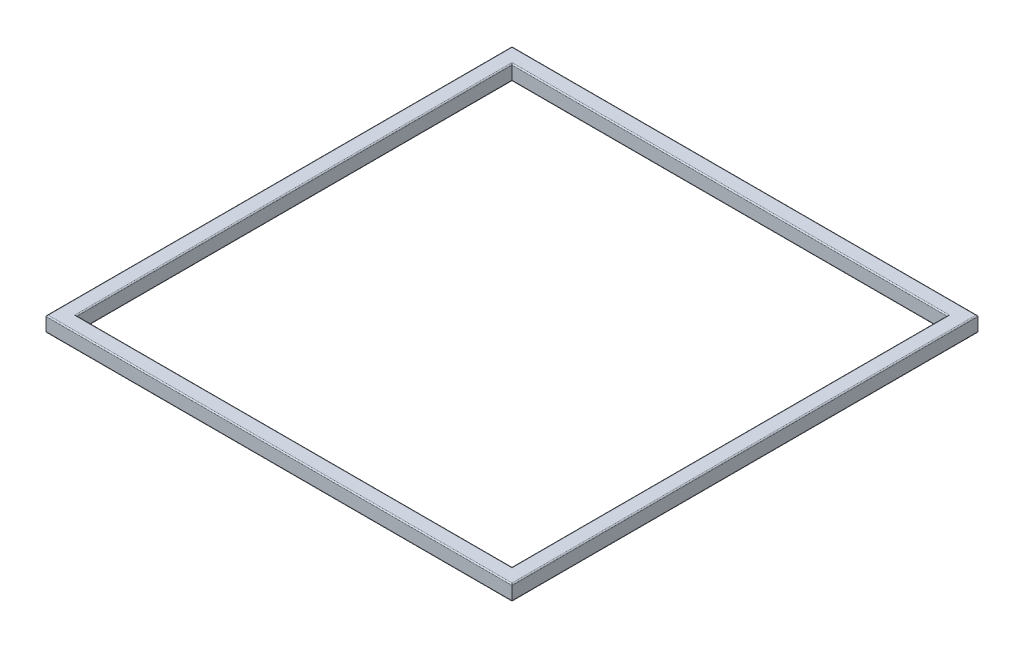
ISO-10303-21;
HEADER;
FILE_DESCRIPTION(('STEP AP214'),'2;1');
FILE_NAME('part.step','',(''),(''),'','','');
FILE_SCHEMA(('AUTOMOTIVE_DESIGN { 1 0 10303 214 1 1 1 1 }'));
ENDSEC;
DATA;
#1=APPLICATION_CONTEXT('core data for automotive mechanical design processes');
#2=APPLICATION_PROTOCOL_DEFINITION('international standard','automotive_design',2000,#1);
#3=PRODUCT_CONTEXT('',#1,'mechanical');
#4=PRODUCT('Part','Part','',(#3));
#5=PRODUCT_RELATED_PRODUCT_CATEGORY('part','',(#4));
#6=PRODUCT_DEFINITION_FORMATION('','',#4);
#7=PRODUCT_DEFINITION_CONTEXT('part definition',#1,'design');
#8=PRODUCT_DEFINITION('design','',#6,#7);
#9=PRODUCT_DEFINITION_SHAPE('','',#8);
#10=(LENGTH_UNIT() NAMED_UNIT(*) SI_UNIT(.MILLI.,.METRE.));
#11=(NAMED_UNIT(*) PLANE_ANGLE_UNIT() SI_UNIT($,.RADIAN.));
#12=(NAMED_UNIT(*) SI_UNIT($,.STERADIAN.) SOLID_ANGLE_UNIT());
#13=UNCERTAINTY_MEASURE_WITH_UNIT(LENGTH_MEASURE(1.E-05),#10,'distance_accuracy_value','');
#14=(GEOMETRIC_REPRESENTATION_CONTEXT(3) GLOBAL_UNCERTAINTY_ASSIGNED_CONTEXT((#13)) GLOBAL_UNIT_ASSIGNED_CONTEXT((#10,
#11,#12)) REPRESENTATION_CONTEXT('',''));
#15=CARTESIAN_POINT('',(0.,0.,0.));
#16=DIRECTION('',(0.,0.,1.));
#17=DIRECTION('',(1.,0.,0.));
#18=AXIS2_PLACEMENT_3D('',#15,#16,#17);
#19=CARTESIAN_POINT('',(0.,40.,0.));
#20=DIRECTION('',(0.,1.,0.));
#21=DIRECTION('',(0.,0.,1.));
#22=AXIS2_PLACEMENT_3D('',#19,#20,#21);
#23=PLANE('',#22);
#24=DIRECTION('',(1.,0.,0.));
#25=VECTOR('',#24,1.);
#26=CARTESIAN_POINT('',(0.,40.,572.999999999998));
#27=LINE('',#26,#25);
#28=CARTESIAN_POINT('',(572.999999999998,40.,572.999999999998));
#29=VERTEX_POINT('',#28);
#30=CARTESIAN_POINT('',(-572.999999999999,40.,572.999999999998));
#31=VERTEX_POINT('',#30);
#32=EDGE_CURVE('E53',#29,#31,#27,.F.);
#33=ORIENTED_EDGE('',*,*,#32,.T.);
#34=DIRECTION('',(0.,0.,1.));
#35=VECTOR('',#34,1.);
#36=CARTESIAN_POINT('',(-572.999999999999,40.,0.));
#37=LINE('',#36,#35);
#38=CARTESIAN_POINT('',(-572.999999999999,40.,-572.999999999999));
#39=VERTEX_POINT('',#38);
#40=EDGE_CURVE('E11',#31,#39,#37,.F.);
#41=ORIENTED_EDGE('',*,*,#40,.T.);
#42=DIRECTION('',(-1.,0.,0.));
#43=VECTOR('',#42,1.);
#44=CARTESIAN_POINT('',(-1.6740994555532E-13,40.,-572.999999999999));
#45=LINE('',#44,#43);
#46=CARTESIAN_POINT('',(572.999999999998,40.,-572.999999999999));
#47=VERTEX_POINT('',#46);
#48=EDGE_CURVE('E385',#39,#47,#45,.F.);
#49=ORIENTED_EDGE('',*,*,#48,.T.);
#50=DIRECTION('',(0.,0.,-1.));
#51=VECTOR('',#50,1.);
#52=CARTESIAN_POINT('',(572.999999999998,40.,0.));
#53=LINE('',#52,#51);
#54=EDGE_CURVE('E64',#47,#29,#53,.F.);
#55=ORIENTED_EDGE('',*,*,#54,.T.);
#56=EDGE_LOOP('',(#33,#41,#49,#55));
#57=FACE_BOUND('',#56,.T.);
#58=DIRECTION('',(0.,0.,1.));
#59=VECTOR('',#58,1.);
#60=CARTESIAN_POINT('',(-606.999999999993,40.,610.000000000001));
#61=LINE('',#60,#59);
#62=CARTESIAN_POINT('',(-606.999999999993,40.,-606.999999999999));
#63=VERTEX_POINT('',#62);
#64=CARTESIAN_POINT('',(-606.999999999993,40.,607.000000000001));
#65=VERTEX_POINT('',#64);
#66=EDGE_CURVE('E378',#63,#65,#61,.T.);
#67=ORIENTED_EDGE('',*,*,#66,.T.);
#68=DIRECTION('',(1.,0.,0.));
#69=VECTOR('',#68,1.);
#70=CARTESIAN_POINT('',(609.999999999996,40.,607.000000000001));
#71=LINE('',#70,#69);
#72=CARTESIAN_POINT('',(606.999999999996,40.,607.000000000001));
#73=VERTEX_POINT('',#72);
#74=EDGE_CURVE('E381',#65,#73,#71,.T.);
#75=ORIENTED_EDGE('',*,*,#74,.T.);
#76=DIRECTION('',(0.,0.,-1.));
#77=VECTOR('',#76,1.);
#78=CARTESIAN_POINT('',(606.999999999996,40.,-609.999999999999));
#79=LINE('',#78,#77);
#80=CARTESIAN_POINT('',(606.999999999996,40.,-606.999999999999));
#81=VERTEX_POINT('',#80);
#82=EDGE_CURVE('E372',#73,#81,#79,.T.);
#83=ORIENTED_EDGE('',*,*,#82,.T.);
#84=DIRECTION('',(-1.,0.,0.));
#85=VECTOR('',#84,1.);
#86=CARTESIAN_POINT('',(-609.999999999993,40.,-606.999999999999));
#87=LINE('',#86,#85);
#88=EDGE_CURVE('E375',#81,#63,#87,.T.);
#89=ORIENTED_EDGE('',*,*,#88,.T.);
#90=EDGE_LOOP('',(#67,#75,#83,#89));
#91=FACE_BOUND('',#90,.T.);
#92=ADVANCED_FACE('F42',(#57,#91),#23,.T.);
#93=CARTESIAN_POINT('',(0.,0.,0.));
#94=DIRECTION('',(0.,1.,0.));
#95=DIRECTION('',(0.,0.,1.));
#96=AXIS2_PLACEMENT_3D('',#93,#94,#95);
#97=PLANE('',#96);
#98=DIRECTION('',(0.,0.,1.));
#99=VECTOR('',#98,1.);
#100=CARTESIAN_POINT('',(-572.999999999999,0.,569.999999999998));
#101=LINE('',#100,#99);
#102=CARTESIAN_POINT('',(-572.999999999999,0.,-572.999999999999));
#103=VERTEX_POINT('',#102);
#104=CARTESIAN_POINT('',(-572.999999999999,0.,572.999999999998));
#105=VERTEX_POINT('',#104);
#106=EDGE_CURVE('E313',#103,#105,#101,.T.);
#107=ORIENTED_EDGE('',*,*,#106,.T.);
#108=DIRECTION('',(1.,0.,0.));
#109=VECTOR('',#108,1.);
#110=CARTESIAN_POINT('',(569.999999999998,0.,572.999999999998));
#111=LINE('',#110,#109);
#112=CARTESIAN_POINT('',(572.999999999998,0.,572.999999999998));
#113=VERTEX_POINT('',#112);
#114=EDGE_CURVE('E316',#105,#113,#111,.T.);
#115=ORIENTED_EDGE('',*,*,#114,.T.);
#116=DIRECTION('',(0.,0.,-1.));
#117=VECTOR('',#116,1.);
#118=CARTESIAN_POINT('',(572.999999999998,0.,-569.999999999999));
#119=LINE('',#118,#117);
#120=CARTESIAN_POINT('',(572.999999999998,0.,-572.999999999999));
#121=VERTEX_POINT('',#120);
#122=EDGE_CURVE('E307',#113,#121,#119,.T.);
#123=ORIENTED_EDGE('',*,*,#122,.T.);
#124=DIRECTION('',(-1.,0.,0.));
#125=VECTOR('',#124,1.);
#126=CARTESIAN_POINT('',(-569.999999999999,0.,-572.999999999999));
#127=LINE('',#126,#125);
#128=EDGE_CURVE('E310',#121,#103,#127,.T.);
#129=ORIENTED_EDGE('',*,*,#128,.T.);
#130=EDGE_LOOP('',(#107,#115,#123,#129));
#131=FACE_BOUND('',#130,.T.);
#132=DIRECTION('',(0.,0.,1.));
#133=VECTOR('',#132,1.);
#134=CARTESIAN_POINT('',(-606.999999999993,0.,0.));
#135=LINE('',#134,#133);
#136=CARTESIAN_POINT('',(-606.999999999993,0.,607.000000000001));
#137=VERTEX_POINT('',#136);
#138=CARTESIAN_POINT('',(-606.999999999993,0.,-606.999999999999));
#139=VERTEX_POINT('',#138);
#140=EDGE_CURVE('E300',#137,#139,#135,.F.);
#141=ORIENTED_EDGE('',*,*,#140,.T.);
#142=DIRECTION('',(-1.,0.,0.));
#143=VECTOR('',#142,1.);
#144=CARTESIAN_POINT('',(0.,0.,-606.999999999999));
#145=LINE('',#144,#143);
#146=CARTESIAN_POINT('',(606.999999999996,0.,-606.999999999999));
#147=VERTEX_POINT('',#146);
#148=EDGE_CURVE('E303',#139,#147,#145,.F.);
#149=ORIENTED_EDGE('',*,*,#148,.T.);
#150=DIRECTION('',(0.,0.,-1.));
#151=VECTOR('',#150,1.);
#152=CARTESIAN_POINT('',(606.999999999996,0.,0.));
#153=LINE('',#152,#151);
#154=CARTESIAN_POINT('',(606.999999999996,0.,607.000000000001));
#155=VERTEX_POINT('',#154);
#156=EDGE_CURVE('E226',#147,#155,#153,.F.);
#157=ORIENTED_EDGE('',*,*,#156,.T.);
#158=DIRECTION('',(1.,0.,0.));
#159=VECTOR('',#158,1.);
#160=CARTESIAN_POINT('',(0.,0.,607.000000000001));
#161=LINE('',#160,#159);
#162=EDGE_CURVE('E297',#155,#137,#161,.F.);
#163=ORIENTED_EDGE('',*,*,#162,.T.);
#164=EDGE_LOOP('',(#141,#149,#157,#163));
#165=FACE_BOUND('',#164,.T.);
#166=ADVANCED_FACE('F588',(#131,#165),#97,.F.);
#167=CARTESIAN_POINT('',(609.999999999996,40.,-609.999999999999));
#168=DIRECTION('',(-1.,0.,0.));
#169=DIRECTION('',(0.,0.,1.));
#170=AXIS2_PLACEMENT_3D('',#167,#168,#169);
#171=PLANE('',#170);
#172=DIRECTION('',(0.,-1.,0.));
#173=VECTOR('',#172,1.);
#174=CARTESIAN_POINT('',(609.999999999996,40.,610.000000000001));
#175=LINE('',#174,#173);
#176=CARTESIAN_POINT('',(609.999999999996,37.,610.000000000001));
#177=VERTEX_POINT('',#176);
#178=CARTESIAN_POINT('',(609.999999999996,3.,610.000000000001));
#179=VERTEX_POINT('',#178);
#180=EDGE_CURVE('E866',#177,#179,#175,.T.);
#181=ORIENTED_EDGE('',*,*,#180,.T.);
#182=DIRECTION('',(0.,0.,-1.));
#183=VECTOR('',#182,1.);
#184=CARTESIAN_POINT('',(609.999999999996,3.,-609.999999999999));
#185=LINE('',#184,#183);
#186=CARTESIAN_POINT('',(609.999999999996,3.,-609.999999999999));
#187=VERTEX_POINT('',#186);
#188=EDGE_CURVE('E369',#179,#187,#185,.T.);
#189=ORIENTED_EDGE('',*,*,#188,.T.);
#190=DIRECTION('',(0.,-1.,0.));
#191=VECTOR('',#190,1.);
#192=CARTESIAN_POINT('',(609.999999999996,40.,-609.999999999999));
#193=LINE('',#192,#191);
#194=CARTESIAN_POINT('',(609.999999999996,37.,-609.999999999999));
#195=VERTEX_POINT('',#194);
#196=EDGE_CURVE('E294',#195,#187,#193,.T.);
#197=ORIENTED_EDGE('',*,*,#196,.F.);
#198=DIRECTION('',(0.,0.,-1.));
#199=VECTOR('',#198,1.);
#200=CARTESIAN_POINT('',(609.999999999996,37.,610.000000000001));
#201=LINE('',#200,#199);
#202=EDGE_CURVE('E366',#195,#177,#201,.F.);
#203=ORIENTED_EDGE('',*,*,#202,.T.);
#204=EDGE_LOOP('',(#181,#189,#197,#203));
#205=FACE_BOUND('',#204,.T.);
#206=ADVANCED_FACE('F468',(#205),#171,.F.);
#207=CARTESIAN_POINT('',(-609.999999999993,40.,-609.999999999999));
#208=DIRECTION('',(0.,0.,1.));
#209=DIRECTION('',(1.,0.,0.));
#210=AXIS2_PLACEMENT_3D('',#207,#208,#209);
#211=PLANE('',#210);
#212=ORIENTED_EDGE('',*,*,#196,.T.);
#213=DIRECTION('',(-1.,0.,0.));
#214=VECTOR('',#213,1.);
#215=CARTESIAN_POINT('',(-609.999999999993,3.,-609.999999999999));
#216=LINE('',#215,#214);
#217=CARTESIAN_POINT('',(-609.999999999993,3.,-609.999999999999));
#218=VERTEX_POINT('',#217);
#219=EDGE_CURVE('E349',#187,#218,#216,.T.);
#220=ORIENTED_EDGE('',*,*,#219,.T.);
#221=DIRECTION('',(0.,-1.,0.));
#222=VECTOR('',#221,1.);
#223=CARTESIAN_POINT('',(-609.999999999993,40.,-609.999999999999));
#224=LINE('',#223,#222);
#225=CARTESIAN_POINT('',(-609.999999999993,37.,-609.999999999999));
#226=VERTEX_POINT('',#225);
#227=EDGE_CURVE('E465',#226,#218,#224,.T.);
#228=ORIENTED_EDGE('',*,*,#227,.F.);
#229=DIRECTION('',(-1.,0.,0.));
#230=VECTOR('',#229,1.);
#231=CARTESIAN_POINT('',(609.999999999996,37.,-609.999999999999));
#232=LINE('',#231,#230);
#233=EDGE_CURVE('E346',#226,#195,#232,.F.);
#234=ORIENTED_EDGE('',*,*,#233,.T.);
#235=EDGE_LOOP('',(#212,#220,#228,#234));
#236=FACE_BOUND('',#235,.T.);
#237=ADVANCED_FACE('F462',(#236),#211,.F.);
#238=CARTESIAN_POINT('',(-609.999999999993,40.,-609.999999999999));
#239=DIRECTION('',(1.,0.,0.));
#240=DIRECTION('',(0.,0.,-1.));
#241=AXIS2_PLACEMENT_3D('',#238,#239,#240);
#242=PLANE('',#241);
#243=ORIENTED_EDGE('',*,*,#227,.T.);
#244=DIRECTION('',(0.,0.,1.));
#245=VECTOR('',#244,1.);
#246=CARTESIAN_POINT('',(-609.999999999993,3.,-609.999999999999));
#247=LINE('',#246,#245);
#248=CARTESIAN_POINT('',(-609.999999999993,3.,610.000000000001));
#249=VERTEX_POINT('',#248);
#250=EDGE_CURVE('E356',#218,#249,#247,.T.);
#251=ORIENTED_EDGE('',*,*,#250,.T.);
#252=DIRECTION('',(0.,-1.,0.));
#253=VECTOR('',#252,1.);
#254=CARTESIAN_POINT('',(-609.999999999993,40.,610.000000000001));
#255=LINE('',#254,#253);
#256=CARTESIAN_POINT('',(-609.999999999993,37.,610.000000000001));
#257=VERTEX_POINT('',#256);
#258=EDGE_CURVE('E474',#257,#249,#255,.T.);
#259=ORIENTED_EDGE('',*,*,#258,.F.);
#260=DIRECTION('',(0.,0.,1.));
#261=VECTOR('',#260,1.);
#262=CARTESIAN_POINT('',(-609.999999999993,37.,-609.999999999999));
#263=LINE('',#262,#261);
#264=EDGE_CURVE('E353',#257,#226,#263,.F.);
#265=ORIENTED_EDGE('',*,*,#264,.T.);
#266=EDGE_LOOP('',(#243,#251,#259,#265));
#267=FACE_BOUND('',#266,.T.);
#268=ADVANCED_FACE('F603',(#267),#242,.F.);
#269=CARTESIAN_POINT('',(-609.999999999993,40.,610.000000000001));
#270=DIRECTION('',(0.,0.,-1.));
#271=DIRECTION('',(-1.,0.,0.));
#272=AXIS2_PLACEMENT_3D('',#269,#270,#271);
#273=PLANE('',#272);
#274=ORIENTED_EDGE('',*,*,#258,.T.);
#275=DIRECTION('',(1.,0.,0.));
#276=VECTOR('',#275,1.);
#277=CARTESIAN_POINT('',(-609.999999999993,3.,610.000000000001));
#278=LINE('',#277,#276);
#279=EDGE_CURVE('E363',#249,#179,#278,.T.);
#280=ORIENTED_EDGE('',*,*,#279,.T.);
#281=ORIENTED_EDGE('',*,*,#180,.F.);
#282=DIRECTION('',(1.,0.,0.));
#283=VECTOR('',#282,1.);
#284=CARTESIAN_POINT('',(-609.999999999993,37.,610.000000000001));
#285=LINE('',#284,#283);
#286=EDGE_CURVE('E359',#177,#257,#285,.F.);
#287=ORIENTED_EDGE('',*,*,#286,.T.);
#288=EDGE_LOOP('',(#274,#280,#281,#287));
#289=FACE_BOUND('',#288,.T.);
#290=ADVANCED_FACE('F600',(#289),#273,.F.);
#291=CARTESIAN_POINT('',(569.999999999998,40.,569.999999999998));
#292=DIRECTION('',(-1.,0.,0.));
#293=DIRECTION('',(0.,0.,1.));
#294=AXIS2_PLACEMENT_3D('',#291,#292,#293);
#295=PLANE('',#294);
#296=DIRECTION('',(0.,-1.,0.));
#297=VECTOR('',#296,1.);
#298=CARTESIAN_POINT('',(569.999999999998,40.,-569.999999999999));
#299=LINE('',#298,#297);
#300=CARTESIAN_POINT('',(569.999999999998,37.,-569.999999999999));
#301=VERTEX_POINT('',#300);
#302=CARTESIAN_POINT('',(569.999999999998,3.,-569.999999999999));
#303=VERTEX_POINT('',#302);
#304=EDGE_CURVE('E862',#301,#303,#299,.T.);
#305=ORIENTED_EDGE('',*,*,#304,.T.);
#306=DIRECTION('',(0.,0.,-1.));
#307=VECTOR('',#306,1.);
#308=CARTESIAN_POINT('',(569.999999999998,3.,569.999999999998));
#309=LINE('',#308,#307);
#310=CARTESIAN_POINT('',(569.999999999998,3.,569.999999999998));
#311=VERTEX_POINT('',#310);
#312=EDGE_CURVE('E343',#303,#311,#309,.F.);
#313=ORIENTED_EDGE('',*,*,#312,.T.);
#314=DIRECTION('',(0.,-1.,0.));
#315=VECTOR('',#314,1.);
#316=CARTESIAN_POINT('',(569.999999999998,40.,569.999999999998));
#317=LINE('',#316,#315);
#318=CARTESIAN_POINT('',(569.999999999998,37.,569.999999999998));
#319=VERTEX_POINT('',#318);
#320=EDGE_CURVE('E407',#319,#311,#317,.T.);
#321=ORIENTED_EDGE('',*,*,#320,.F.);
#322=DIRECTION('',(0.,0.,-1.));
#323=VECTOR('',#322,1.);
#324=CARTESIAN_POINT('',(569.999999999998,37.,569.999999999998));
#325=LINE('',#324,#323);
#326=EDGE_CURVE('E340',#319,#301,#325,.T.);
#327=ORIENTED_EDGE('',*,*,#326,.T.);
#328=EDGE_LOOP('',(#305,#313,#321,#327));
#329=FACE_BOUND('',#328,.T.);
#330=ADVANCED_FACE('F597',(#329),#295,.T.);
#331=CARTESIAN_POINT('',(-569.999999999999,40.,-569.999999999999));
#332=DIRECTION('',(0.,0.,1.));
#333=DIRECTION('',(1.,0.,0.));
#334=AXIS2_PLACEMENT_3D('',#331,#332,#333);
#335=PLANE('',#334);
#336=DIRECTION('',(0.,-1.,0.));
#337=VECTOR('',#336,1.);
#338=CARTESIAN_POINT('',(-569.999999999999,40.,-569.999999999999));
#339=LINE('',#338,#337);
#340=CARTESIAN_POINT('',(-569.999999999999,37.,-569.999999999999));
#341=VERTEX_POINT('',#340);
#342=CARTESIAN_POINT('',(-569.999999999999,3.,-569.999999999999));
#343=VERTEX_POINT('',#342);
#344=EDGE_CURVE('E855',#341,#343,#339,.T.);
#345=ORIENTED_EDGE('',*,*,#344,.T.);
#346=DIRECTION('',(-1.,0.,0.));
#347=VECTOR('',#346,1.);
#348=CARTESIAN_POINT('',(569.999999999998,3.,-569.999999999999));
#349=LINE('',#348,#347);
#350=EDGE_CURVE('E337',#343,#303,#349,.F.);
#351=ORIENTED_EDGE('',*,*,#350,.T.);
#352=ORIENTED_EDGE('',*,*,#304,.F.);
#353=DIRECTION('',(-1.,0.,0.));
#354=VECTOR('',#353,1.);
#355=CARTESIAN_POINT('',(-569.999999999999,37.,-569.999999999999));
#356=LINE('',#355,#354);
#357=EDGE_CURVE('E334',#301,#341,#356,.T.);
#358=ORIENTED_EDGE('',*,*,#357,.T.);
#359=EDGE_LOOP('',(#345,#351,#352,#358));
#360=FACE_BOUND('',#359,.T.);
#361=ADVANCED_FACE('F632',(#360),#335,.T.);
#362=CARTESIAN_POINT('',(-569.999999999999,40.,569.999999999998));
#363=DIRECTION('',(1.,0.,0.));
#364=DIRECTION('',(0.,0.,-1.));
#365=AXIS2_PLACEMENT_3D('',#362,#363,#364);
#366=PLANE('',#365);
#367=DIRECTION('',(0.,-1.,0.));
#368=VECTOR('',#367,1.);
#369=CARTESIAN_POINT('',(-569.999999999999,40.,569.999999999998));
#370=LINE('',#369,#368);
#371=CARTESIAN_POINT('',(-569.999999999999,37.,569.999999999998));
#372=VERTEX_POINT('',#371);
#373=CARTESIAN_POINT('',(-569.999999999999,3.,569.999999999998));
#374=VERTEX_POINT('',#373);
#375=EDGE_CURVE('E840',#372,#374,#370,.T.);
#376=ORIENTED_EDGE('',*,*,#375,.T.);
#377=DIRECTION('',(0.,0.,1.));
#378=VECTOR('',#377,1.);
#379=CARTESIAN_POINT('',(-569.999999999999,3.,-569.999999999999));
#380=LINE('',#379,#378);
#381=EDGE_CURVE('E331',#374,#343,#380,.F.);
#382=ORIENTED_EDGE('',*,*,#381,.T.);
#383=ORIENTED_EDGE('',*,*,#344,.F.);
#384=DIRECTION('',(0.,0.,1.));
#385=VECTOR('',#384,1.);
#386=CARTESIAN_POINT('',(-569.999999999999,37.,569.999999999998));
#387=LINE('',#386,#385);
#388=EDGE_CURVE('E327',#341,#372,#387,.T.);
#389=ORIENTED_EDGE('',*,*,#388,.T.);
#390=EDGE_LOOP('',(#376,#382,#383,#389));
#391=FACE_BOUND('',#390,.T.);
#392=ADVANCED_FACE('F639',(#391),#366,.T.);
#393=CARTESIAN_POINT('',(-569.999999999999,40.,569.999999999998));
#394=DIRECTION('',(0.,0.,-1.));
#395=DIRECTION('',(-1.,0.,0.));
#396=AXIS2_PLACEMENT_3D('',#393,#394,#395);
#397=PLANE('',#396);
#398=ORIENTED_EDGE('',*,*,#320,.T.);
#399=DIRECTION('',(1.,0.,0.));
#400=VECTOR('',#399,1.);
#401=CARTESIAN_POINT('',(-569.999999999999,3.,569.999999999998));
#402=LINE('',#401,#400);
#403=EDGE_CURVE('E323',#311,#374,#402,.F.);
#404=ORIENTED_EDGE('',*,*,#403,.T.);
#405=ORIENTED_EDGE('',*,*,#375,.F.);
#406=DIRECTION('',(1.,0.,0.));
#407=VECTOR('',#406,1.);
#408=CARTESIAN_POINT('',(-569.999999999999,37.,569.999999999998));
#409=LINE('',#408,#407);
#410=EDGE_CURVE('E320',#372,#319,#409,.T.);
#411=ORIENTED_EDGE('',*,*,#410,.T.);
#412=EDGE_LOOP('',(#398,#404,#405,#411));
#413=FACE_BOUND('',#412,.T.);
#414=ADVANCED_FACE('F544',(#413),#397,.T.);
#415=CARTESIAN_POINT('',(-1.6740994555532E-13,3.,-572.999999999999));
#416=DIRECTION('',(1.,0.,0.));
#417=DIRECTION('',(0.,0.,-1.));
#418=AXIS2_PLACEMENT_3D('',#415,#416,#417);
#419=CYLINDRICAL_SURFACE('',#418,3.);
#420=CARTESIAN_POINT('',(572.999999999998,3.,-572.999999999999));
#421=DIRECTION('',(0.707106781186548,0.,0.707106781186547));
#422=DIRECTION('',(0.707106781186547,0.,-0.707106781186548));
#423=AXIS2_PLACEMENT_3D('',#420,#421,#422);
#424=ELLIPSE('',#423,4.24264068711929,3.);
#425=EDGE_CURVE('E399',#303,#121,#424,.T.);
#426=ORIENTED_EDGE('',*,*,#425,.F.);
#427=ORIENTED_EDGE('',*,*,#350,.F.);
#428=CARTESIAN_POINT('',(-572.999999999999,3.,-572.999999999999));
#429=DIRECTION('',(0.707106781186547,0.,-0.707106781186548));
#430=DIRECTION('',(-0.707106781186548,0.,-0.707106781186547));
#431=AXIS2_PLACEMENT_3D('',#428,#429,#430);
#432=ELLIPSE('',#431,4.24264068711928,3.);
#433=EDGE_CURVE('E403',#103,#343,#432,.F.);
#434=ORIENTED_EDGE('',*,*,#433,.F.);
#435=ORIENTED_EDGE('',*,*,#128,.F.);
#436=EDGE_LOOP('',(#426,#427,#434,#435));
#437=FACE_BOUND('',#436,.T.);
#438=ADVANCED_FACE('F540',(#437),#419,.T.);
#439=CARTESIAN_POINT('',(-572.999999999999,3.,0.));
#440=DIRECTION('',(0.,0.,-1.));
#441=DIRECTION('',(-1.,0.,0.));
#442=AXIS2_PLACEMENT_3D('',#439,#440,#441);
#443=CYLINDRICAL_SURFACE('',#442,3.);
#444=ORIENTED_EDGE('',*,*,#433,.T.);
#445=ORIENTED_EDGE('',*,*,#381,.F.);
#446=CARTESIAN_POINT('',(-572.999999999999,3.,572.999999999998));
#447=DIRECTION('',(-0.707106781186547,0.,-0.707106781186547));
#448=DIRECTION('',(-0.707106781186547,0.,0.707106781186547));
#449=AXIS2_PLACEMENT_3D('',#446,#447,#448);
#450=ELLIPSE('',#449,4.24264068711928,3.);
#451=EDGE_CURVE('E395',#105,#374,#450,.F.);
#452=ORIENTED_EDGE('',*,*,#451,.F.);
#453=ORIENTED_EDGE('',*,*,#106,.F.);
#454=EDGE_LOOP('',(#444,#445,#452,#453));
#455=FACE_BOUND('',#454,.T.);
#456=ADVANCED_FACE('F536',(#455),#443,.T.);
#457=CARTESIAN_POINT('',(572.999999999998,3.,0.));
#458=DIRECTION('',(0.,0.,1.));
#459=DIRECTION('',(1.,0.,0.));
#460=AXIS2_PLACEMENT_3D('',#457,#458,#459);
#461=CYLINDRICAL_SURFACE('',#460,3.);
#462=ORIENTED_EDGE('',*,*,#425,.T.);
#463=ORIENTED_EDGE('',*,*,#122,.F.);
#464=CARTESIAN_POINT('',(572.999999999998,3.,572.999999999998));
#465=DIRECTION('',(-0.707106781186547,0.,0.707106781186547));
#466=DIRECTION('',(-0.707106781186547,0.,-0.707106781186548));
#467=AXIS2_PLACEMENT_3D('',#464,#465,#466);
#468=ELLIPSE('',#467,4.24264068711928,3.);
#469=EDGE_CURVE('E392',#311,#113,#468,.T.);
#470=ORIENTED_EDGE('',*,*,#469,.F.);
#471=ORIENTED_EDGE('',*,*,#312,.F.);
#472=EDGE_LOOP('',(#462,#463,#470,#471));
#473=FACE_BOUND('',#472,.T.);
#474=ADVANCED_FACE('F532',(#473),#461,.T.);
#475=CARTESIAN_POINT('',(0.,3.,572.999999999998));
#476=DIRECTION('',(-1.,0.,0.));
#477=DIRECTION('',(0.,0.,1.));
#478=AXIS2_PLACEMENT_3D('',#475,#476,#477);
#479=CYLINDRICAL_SURFACE('',#478,3.);
#480=ORIENTED_EDGE('',*,*,#451,.T.);
#481=ORIENTED_EDGE('',*,*,#403,.F.);
#482=ORIENTED_EDGE('',*,*,#469,.T.);
#483=ORIENTED_EDGE('',*,*,#114,.F.);
#484=EDGE_LOOP('',(#480,#481,#482,#483));
#485=FACE_BOUND('',#484,.T.);
#486=ADVANCED_FACE('F528',(#485),#479,.T.);
#487=CARTESIAN_POINT('',(-609.999999999993,3.,607.000000000001));
#488=DIRECTION('',(1.,0.,0.));
#489=DIRECTION('',(0.,0.,-1.));
#490=AXIS2_PLACEMENT_3D('',#487,#488,#489);
#491=CYLINDRICAL_SURFACE('',#490,3.);
#492=CARTESIAN_POINT('',(-606.999999999993,3.,607.000000000001));
#493=DIRECTION('',(0.707106781186547,0.,0.707106781186548));
#494=DIRECTION('',(0.707106781186548,0.,-0.707106781186547));
#495=AXIS2_PLACEMENT_3D('',#492,#493,#494);
#496=ELLIPSE('',#495,4.24264068711928,3.);
#497=EDGE_CURVE('E415',#137,#249,#496,.F.);
#498=ORIENTED_EDGE('',*,*,#497,.F.);
#499=ORIENTED_EDGE('',*,*,#162,.F.);
#500=CARTESIAN_POINT('',(606.999999999996,3.,607.000000000001));
#501=DIRECTION('',(0.707106781186547,0.,-0.707106781186547));
#502=DIRECTION('',(-0.707106781186547,0.,-0.707106781186547));
#503=AXIS2_PLACEMENT_3D('',#500,#501,#502);
#504=ELLIPSE('',#503,4.24264068711929,3.);
#505=EDGE_CURVE('E396',#179,#155,#504,.T.);
#506=ORIENTED_EDGE('',*,*,#505,.F.);
#507=ORIENTED_EDGE('',*,*,#279,.F.);
#508=EDGE_LOOP('',(#498,#499,#506,#507));
#509=FACE_BOUND('',#508,.T.);
#510=ADVANCED_FACE('F531',(#509),#491,.T.);
#511=CARTESIAN_POINT('',(606.999999999996,3.,-609.999999999999));
#512=DIRECTION('',(0.,0.,-1.));
#513=DIRECTION('',(-1.,0.,0.));
#514=AXIS2_PLACEMENT_3D('',#511,#512,#513);
#515=CYLINDRICAL_SURFACE('',#514,3.);
#516=ORIENTED_EDGE('',*,*,#505,.T.);
#517=ORIENTED_EDGE('',*,*,#156,.F.);
#518=CARTESIAN_POINT('',(606.999999999996,3.,-606.999999999999));
#519=DIRECTION('',(-0.707106781186547,0.,-0.707106781186547));
#520=DIRECTION('',(0.707106781186547,0.,-0.707106781186548));
#521=AXIS2_PLACEMENT_3D('',#518,#519,#520);
#522=ELLIPSE('',#521,4.24264068711928,3.);
#523=EDGE_CURVE('E411',#187,#147,#522,.T.);
#524=ORIENTED_EDGE('',*,*,#523,.F.);
#525=ORIENTED_EDGE('',*,*,#188,.F.);
#526=EDGE_LOOP('',(#516,#517,#524,#525));
#527=FACE_BOUND('',#526,.T.);
#528=ADVANCED_FACE('F554',(#527),#515,.T.);
#529=CARTESIAN_POINT('',(-606.999999999993,3.,-609.999999999999));
#530=DIRECTION('',(0.,0.,1.));
#531=DIRECTION('',(1.,0.,0.));
#532=AXIS2_PLACEMENT_3D('',#529,#530,#531);
#533=CYLINDRICAL_SURFACE('',#532,3.);
#534=ORIENTED_EDGE('',*,*,#497,.T.);
#535=ORIENTED_EDGE('',*,*,#250,.F.);
#536=CARTESIAN_POINT('',(-606.999999999993,3.,-606.999999999999));
#537=DIRECTION('',(-0.707106781186547,0.,0.707106781186547));
#538=DIRECTION('',(0.707106781186547,0.,0.707106781186548));
#539=AXIS2_PLACEMENT_3D('',#536,#537,#538);
#540=ELLIPSE('',#539,4.24264068711928,3.);
#541=EDGE_CURVE('E408',#139,#218,#540,.F.);
#542=ORIENTED_EDGE('',*,*,#541,.F.);
#543=ORIENTED_EDGE('',*,*,#140,.F.);
#544=EDGE_LOOP('',(#534,#535,#542,#543));
#545=FACE_BOUND('',#544,.T.);
#546=ADVANCED_FACE('F550',(#545),#533,.T.);
#547=CARTESIAN_POINT('',(-609.999999999993,3.,-606.999999999999));
#548=DIRECTION('',(-1.,0.,0.));
#549=DIRECTION('',(0.,0.,1.));
#550=AXIS2_PLACEMENT_3D('',#547,#548,#549);
#551=CYLINDRICAL_SURFACE('',#550,3.);
#552=ORIENTED_EDGE('',*,*,#523,.T.);
#553=ORIENTED_EDGE('',*,*,#148,.F.);
#554=ORIENTED_EDGE('',*,*,#541,.T.);
#555=ORIENTED_EDGE('',*,*,#219,.F.);
#556=EDGE_LOOP('',(#552,#553,#554,#555));
#557=FACE_BOUND('',#556,.T.);
#558=ADVANCED_FACE('F546',(#557),#551,.T.);
#559=CARTESIAN_POINT('',(572.999999999998,37.,569.999999999998));
#560=DIRECTION('',(0.,0.,-1.));
#561=DIRECTION('',(-1.,0.,0.));
#562=AXIS2_PLACEMENT_3D('',#559,#560,#561);
#563=CYLINDRICAL_SURFACE('',#562,3.);
#564=CARTESIAN_POINT('',(572.999999999998,37.,572.999999999998));
#565=DIRECTION('',(0.707106781186547,0.,-0.707106781186547));
#566=DIRECTION('',(0.707106781186547,0.,0.707106781186548));
#567=AXIS2_PLACEMENT_3D('',#564,#565,#566);
#568=ELLIPSE('',#567,4.24264068711928,3.);
#569=EDGE_CURVE('E428',#29,#319,#568,.F.);
#570=ORIENTED_EDGE('',*,*,#569,.F.);
#571=ORIENTED_EDGE('',*,*,#54,.F.);
#572=CARTESIAN_POINT('',(572.999999999998,37.,-572.999999999999));
#573=DIRECTION('',(-0.707106781186548,0.,-0.707106781186547));
#574=DIRECTION('',(0.707106781186547,0.,-0.707106781186548));
#575=AXIS2_PLACEMENT_3D('',#572,#573,#574);
#576=ELLIPSE('',#575,4.24264068711929,3.);
#577=EDGE_CURVE('E412',#301,#47,#576,.T.);
#578=ORIENTED_EDGE('',*,*,#577,.F.);
#579=ORIENTED_EDGE('',*,*,#326,.F.);
#580=EDGE_LOOP('',(#570,#571,#578,#579));
#581=FACE_BOUND('',#580,.T.);
#582=ADVANCED_FACE('F549',(#581),#563,.T.);
#583=CARTESIAN_POINT('',(-569.999999999999,37.,-572.999999999999));
#584=DIRECTION('',(-1.,0.,0.));
#585=DIRECTION('',(0.,0.,1.));
#586=AXIS2_PLACEMENT_3D('',#583,#584,#585);
#587=CYLINDRICAL_SURFACE('',#586,3.);
#588=ORIENTED_EDGE('',*,*,#577,.T.);
#589=ORIENTED_EDGE('',*,*,#48,.F.);
#590=CARTESIAN_POINT('',(-572.999999999999,37.,-572.999999999998));
#591=DIRECTION('',(-0.707106781186547,0.,0.707106781186548));
#592=DIRECTION('',(0.707106781186548,0.,0.707106781186547));
#593=AXIS2_PLACEMENT_3D('',#590,#591,#592);
#594=ELLIPSE('',#593,4.24264068711928,3.);
#595=EDGE_CURVE('E425',#341,#39,#594,.T.);
#596=ORIENTED_EDGE('',*,*,#595,.F.);
#597=ORIENTED_EDGE('',*,*,#357,.F.);
#598=EDGE_LOOP('',(#588,#589,#596,#597));
#599=FACE_BOUND('',#598,.T.);
#600=ADVANCED_FACE('F569',(#599),#587,.T.);
#601=CARTESIAN_POINT('',(-569.999999999999,37.,572.999999999998));
#602=DIRECTION('',(1.,0.,0.));
#603=DIRECTION('',(0.,0.,-1.));
#604=AXIS2_PLACEMENT_3D('',#601,#602,#603);
#605=CYLINDRICAL_SURFACE('',#604,3.);
#606=ORIENTED_EDGE('',*,*,#569,.T.);
#607=ORIENTED_EDGE('',*,*,#410,.F.);
#608=CARTESIAN_POINT('',(-572.999999999999,37.,572.999999999998));
#609=DIRECTION('',(0.707106781186547,0.,0.707106781186547));
#610=DIRECTION('',(-0.707106781186547,0.,0.707106781186547));
#611=AXIS2_PLACEMENT_3D('',#608,#609,#610);
#612=ELLIPSE('',#611,4.24264068711928,3.);
#613=EDGE_CURVE('E422',#31,#372,#612,.F.);
#614=ORIENTED_EDGE('',*,*,#613,.F.);
#615=ORIENTED_EDGE('',*,*,#32,.F.);
#616=EDGE_LOOP('',(#606,#607,#614,#615));
#617=FACE_BOUND('',#616,.T.);
#618=ADVANCED_FACE('F565',(#617),#605,.T.);
#619=CARTESIAN_POINT('',(-572.999999999999,37.,569.999999999998));
#620=DIRECTION('',(0.,0.,1.));
#621=DIRECTION('',(1.,0.,0.));
#622=AXIS2_PLACEMENT_3D('',#619,#620,#621);
#623=CYLINDRICAL_SURFACE('',#622,3.);
#624=ORIENTED_EDGE('',*,*,#595,.T.);
#625=ORIENTED_EDGE('',*,*,#40,.F.);
#626=ORIENTED_EDGE('',*,*,#613,.T.);
#627=ORIENTED_EDGE('',*,*,#388,.F.);
#628=EDGE_LOOP('',(#624,#625,#626,#627));
#629=FACE_BOUND('',#628,.T.);
#630=ADVANCED_FACE('F562',(#629),#623,.T.);
#631=CARTESIAN_POINT('',(0.,37.,-606.999999999999));
#632=DIRECTION('',(1.,0.,0.));
#633=DIRECTION('',(0.,0.,-1.));
#634=AXIS2_PLACEMENT_3D('',#631,#632,#633);
#635=CYLINDRICAL_SURFACE('',#634,3.);
#636=CARTESIAN_POINT('',(606.999999999996,37.,-606.999999999999));
#637=DIRECTION('',(0.707106781186547,0.,0.707106781186547));
#638=DIRECTION('',(-0.707106781186547,0.,0.707106781186548));
#639=AXIS2_PLACEMENT_3D('',#636,#637,#638);
#640=ELLIPSE('',#639,4.24264068711928,3.);
#641=EDGE_CURVE('E440',#195,#81,#640,.T.);
#642=ORIENTED_EDGE('',*,*,#641,.F.);
#643=ORIENTED_EDGE('',*,*,#233,.F.);
#644=CARTESIAN_POINT('',(-606.999999999993,37.,-606.999999999999));
#645=DIRECTION('',(0.707106781186547,0.,-0.707106781186547));
#646=DIRECTION('',(0.707106781186547,0.,0.707106781186548));
#647=AXIS2_PLACEMENT_3D('',#644,#645,#646);
#648=ELLIPSE('',#647,4.24264068711928,3.);
#649=EDGE_CURVE('E46',#63,#226,#648,.F.);
#650=ORIENTED_EDGE('',*,*,#649,.F.);
#651=ORIENTED_EDGE('',*,*,#88,.F.);
#652=EDGE_LOOP('',(#642,#643,#650,#651));
#653=FACE_BOUND('',#652,.T.);
#654=ADVANCED_FACE('F44',(#653),#635,.T.);
#655=CARTESIAN_POINT('',(-606.999999999993,37.,0.));
#656=DIRECTION('',(0.,0.,-1.));
#657=DIRECTION('',(-1.,0.,0.));
#658=AXIS2_PLACEMENT_3D('',#655,#656,#657);
#659=CYLINDRICAL_SURFACE('',#658,3.);
#660=ORIENTED_EDGE('',*,*,#649,.T.);
#661=ORIENTED_EDGE('',*,*,#264,.F.);
#662=CARTESIAN_POINT('',(-606.999999999993,37.,607.000000000001));
#663=DIRECTION('',(-0.707106781186547,0.,-0.707106781186548));
#664=DIRECTION('',(0.707106781186548,0.,-0.707106781186547));
#665=AXIS2_PLACEMENT_3D('',#662,#663,#664);
#666=ELLIPSE('',#665,4.24264068711928,3.);
#667=EDGE_CURVE('E438',#65,#257,#666,.F.);
#668=ORIENTED_EDGE('',*,*,#667,.F.);
#669=ORIENTED_EDGE('',*,*,#66,.F.);
#670=EDGE_LOOP('',(#660,#661,#668,#669));
#671=FACE_BOUND('',#670,.T.);
#672=ADVANCED_FACE('F453',(#671),#659,.T.);
#673=CARTESIAN_POINT('',(606.999999999996,37.,0.));
#674=DIRECTION('',(0.,0.,1.));
#675=DIRECTION('',(1.,0.,0.));
#676=AXIS2_PLACEMENT_3D('',#673,#674,#675);
#677=CYLINDRICAL_SURFACE('',#676,3.);
#678=ORIENTED_EDGE('',*,*,#641,.T.);
#679=ORIENTED_EDGE('',*,*,#82,.F.);
#680=CARTESIAN_POINT('',(606.999999999996,37.,607.000000000001));
#681=DIRECTION('',(-0.707106781186547,0.,0.707106781186547));
#682=DIRECTION('',(0.707106781186547,0.,0.707106781186547));
#683=AXIS2_PLACEMENT_3D('',#680,#681,#682);
#684=ELLIPSE('',#683,4.24264068711929,3.);
#685=EDGE_CURVE('E435',#177,#73,#684,.T.);
#686=ORIENTED_EDGE('',*,*,#685,.F.);
#687=ORIENTED_EDGE('',*,*,#202,.F.);
#688=EDGE_LOOP('',(#678,#679,#686,#687));
#689=FACE_BOUND('',#688,.T.);
#690=ADVANCED_FACE('F580',(#689),#677,.T.);
#691=CARTESIAN_POINT('',(0.,37.,607.000000000001));
#692=DIRECTION('',(-1.,0.,0.));
#693=DIRECTION('',(0.,0.,1.));
#694=AXIS2_PLACEMENT_3D('',#691,#692,#693);
#695=CYLINDRICAL_SURFACE('',#694,3.);
#696=ORIENTED_EDGE('',*,*,#667,.T.);
#697=ORIENTED_EDGE('',*,*,#286,.F.);
#698=ORIENTED_EDGE('',*,*,#685,.T.);
#699=ORIENTED_EDGE('',*,*,#74,.F.);
#700=EDGE_LOOP('',(#696,#697,#698,#699));
#701=FACE_BOUND('',#700,.T.);
#702=ADVANCED_FACE('F577',(#701),#695,.T.);
#703=CLOSED_SHELL('',(#92,#166,#206,#237,#268,#290,#330,#361,#392,#414,#438,#456,#474,#486,#510,
#528,#546,#558,#582,#600,#618,#630,#654,#672,#690,#702));
#704=CARTESIAN_POINT('',(0.,38.,0.));
#705=DIRECTION('',(0.,1.,0.));
#706=DIRECTION('',(0.,0.,1.));
#707=AXIS2_PLACEMENT_3D('',#704,#705,#706);
#708=PLANE('',#707);
#709=DIRECTION('',(0.,0.,-1.));
#710=VECTOR('',#709,1.);
#711=CARTESIAN_POINT('',(607.999999999996,38.,-609.999999999999));
#712=LINE('',#711,#710);
#713=CARTESIAN_POINT('',(607.999999999996,38.,608.000000000001));
#714=VERTEX_POINT('',#713);
#715=CARTESIAN_POINT('',(607.999999999996,38.,-607.999999999999));
#716=VERTEX_POINT('',#715);
#717=EDGE_CURVE('E290',#714,#716,#712,.T.);
#718=ORIENTED_EDGE('',*,*,#717,.F.);
#719=DIRECTION('',(1.,0.,0.));
#720=VECTOR('',#719,1.);
#721=CARTESIAN_POINT('',(-609.999999999993,38.,608.000000000001));
#722=LINE('',#721,#720);
#723=CARTESIAN_POINT('',(-607.999999999993,38.,608.000000000001));
#724=VERTEX_POINT('',#723);
#725=EDGE_CURVE('E281',#724,#714,#722,.T.);
#726=ORIENTED_EDGE('',*,*,#725,.F.);
#727=DIRECTION('',(0.,0.,1.));
#728=VECTOR('',#727,1.);
#729=CARTESIAN_POINT('',(-607.999999999993,38.,-609.999999999999));
#730=LINE('',#729,#728);
#731=CARTESIAN_POINT('',(-607.999999999993,38.,-607.999999999999));
#732=VERTEX_POINT('',#731);
#733=EDGE_CURVE('E284',#732,#724,#730,.T.);
#734=ORIENTED_EDGE('',*,*,#733,.F.);
#735=DIRECTION('',(-1.,0.,0.));
#736=VECTOR('',#735,1.);
#737=CARTESIAN_POINT('',(-609.999999999993,38.,-607.999999999999));
#738=LINE('',#737,#736);
#739=EDGE_CURVE('E287',#716,#732,#738,.T.);
#740=ORIENTED_EDGE('',*,*,#739,.F.);
#741=EDGE_LOOP('',(#718,#726,#734,#740));
#742=FACE_BOUND('',#741,.T.);
#743=DIRECTION('',(-1.,0.,0.));
#744=VECTOR('',#743,1.);
#745=CARTESIAN_POINT('',(-569.999999999999,38.,-571.999999999999));
#746=LINE('',#745,#744);
#747=CARTESIAN_POINT('',(571.999999999998,38.,-571.999999999999));
#748=VERTEX_POINT('',#747);
#749=CARTESIAN_POINT('',(-571.999999999999,38.,-571.999999999999));
#750=VERTEX_POINT('',#749);
#751=EDGE_CURVE('E237',#748,#750,#746,.T.);
#752=ORIENTED_EDGE('',*,*,#751,.T.);
#753=DIRECTION('',(0.,0.,1.));
#754=VECTOR('',#753,1.);
#755=CARTESIAN_POINT('',(-571.999999999999,38.,569.999999999998));
#756=LINE('',#755,#754);
#757=CARTESIAN_POINT('',(-571.999999999999,38.,571.999999999998));
#758=VERTEX_POINT('',#757);
#759=EDGE_CURVE('E212',#750,#758,#756,.T.);
#760=ORIENTED_EDGE('',*,*,#759,.T.);
#761=DIRECTION('',(1.,0.,0.));
#762=VECTOR('',#761,1.);
#763=CARTESIAN_POINT('',(-569.999999999999,38.,571.999999999998));
#764=LINE('',#763,#762);
#765=CARTESIAN_POINT('',(571.999999999998,38.,571.999999999998));
#766=VERTEX_POINT('',#765);
#767=EDGE_CURVE('E205',#758,#766,#764,.T.);
#768=ORIENTED_EDGE('',*,*,#767,.T.);
#769=DIRECTION('',(0.,0.,-1.));
#770=VECTOR('',#769,1.);
#771=CARTESIAN_POINT('',(571.999999999998,38.,569.999999999998));
#772=LINE('',#771,#770);
#773=EDGE_CURVE('E209',#766,#748,#772,.T.);
#774=ORIENTED_EDGE('',*,*,#773,.T.);
#775=EDGE_LOOP('',(#752,#760,#768,#774));
#776=FACE_BOUND('',#775,.T.);
#777=ADVANCED_FACE('F207',(#742,#776),#708,.F.);
#778=CARTESIAN_POINT('',(0.,2.,0.));
#779=DIRECTION('',(0.,1.,0.));
#780=DIRECTION('',(0.,0.,1.));
#781=AXIS2_PLACEMENT_3D('',#778,#779,#780);
#782=PLANE('',#781);
#783=DIRECTION('',(0.,0.,-1.));
#784=VECTOR('',#783,1.);
#785=CARTESIAN_POINT('',(607.999999999996,2.,-609.999999999999));
#786=LINE('',#785,#784);
#787=CARTESIAN_POINT('',(607.999999999996,2.,608.000000000001));
#788=VERTEX_POINT('',#787);
#789=CARTESIAN_POINT('',(607.999999999996,2.,-607.999999999999));
#790=VERTEX_POINT('',#789);
#791=EDGE_CURVE('E264',#788,#790,#786,.T.);
#792=ORIENTED_EDGE('',*,*,#791,.T.);
#793=DIRECTION('',(-1.,0.,0.));
#794=VECTOR('',#793,1.);
#795=CARTESIAN_POINT('',(-609.999999999993,2.,-607.999999999999));
#796=LINE('',#795,#794);
#797=CARTESIAN_POINT('',(-607.999999999993,2.,-607.999999999999));
#798=VERTEX_POINT('',#797);
#799=EDGE_CURVE('E257',#790,#798,#796,.T.);
#800=ORIENTED_EDGE('',*,*,#799,.T.);
#801=DIRECTION('',(0.,0.,1.));
#802=VECTOR('',#801,1.);
#803=CARTESIAN_POINT('',(-607.999999999993,2.,-609.999999999999));
#804=LINE('',#803,#802);
#805=CARTESIAN_POINT('',(-607.999999999993,2.,608.000000000001));
#806=VERTEX_POINT('',#805);
#807=EDGE_CURVE('E250',#798,#806,#804,.T.);
#808=ORIENTED_EDGE('',*,*,#807,.T.);
#809=DIRECTION('',(1.,0.,0.));
#810=VECTOR('',#809,1.);
#811=CARTESIAN_POINT('',(-609.999999999993,2.,608.000000000001));
#812=LINE('',#811,#810);
#813=EDGE_CURVE('E240',#806,#788,#812,.T.);
#814=ORIENTED_EDGE('',*,*,#813,.T.);
#815=EDGE_LOOP('',(#792,#800,#808,#814));
#816=FACE_BOUND('',#815,.T.);
#817=DIRECTION('',(0.,0.,-1.));
#818=VECTOR('',#817,1.);
#819=CARTESIAN_POINT('',(571.999999999998,2.,569.999999999998));
#820=LINE('',#819,#818);
#821=CARTESIAN_POINT('',(571.999999999998,2.,571.999999999998));
#822=VERTEX_POINT('',#821);
#823=CARTESIAN_POINT('',(571.999999999998,2.,-571.999999999999));
#824=VERTEX_POINT('',#823);
#825=EDGE_CURVE('E278',#822,#824,#820,.T.);
#826=ORIENTED_EDGE('',*,*,#825,.F.);
#827=DIRECTION('',(1.,0.,0.));
#828=VECTOR('',#827,1.);
#829=CARTESIAN_POINT('',(-569.999999999999,2.,571.999999999998));
#830=LINE('',#829,#828);
#831=CARTESIAN_POINT('',(-571.999999999999,2.,571.999999999998));
#832=VERTEX_POINT('',#831);
#833=EDGE_CURVE('E222',#832,#822,#830,.T.);
#834=ORIENTED_EDGE('',*,*,#833,.F.);
#835=DIRECTION('',(0.,0.,1.));
#836=VECTOR('',#835,1.);
#837=CARTESIAN_POINT('',(-571.999999999999,2.,569.999999999998));
#838=LINE('',#837,#836);
#839=CARTESIAN_POINT('',(-571.999999999999,2.,-571.999999999999));
#840=VERTEX_POINT('',#839);
#841=EDGE_CURVE('E270',#840,#832,#838,.T.);
#842=ORIENTED_EDGE('',*,*,#841,.F.);
#843=DIRECTION('',(-1.,0.,0.));
#844=VECTOR('',#843,1.);
#845=CARTESIAN_POINT('',(-569.999999999999,2.,-571.999999999999));
#846=LINE('',#845,#844);
#847=EDGE_CURVE('E274',#824,#840,#846,.T.);
#848=ORIENTED_EDGE('',*,*,#847,.F.);
#849=EDGE_LOOP('',(#826,#834,#842,#848));
#850=FACE_BOUND('',#849,.T.);
#851=ADVANCED_FACE('F492',(#816,#850),#782,.T.);
#852=CARTESIAN_POINT('',(607.999999999996,40.,-609.999999999999));
#853=DIRECTION('',(-1.,0.,0.));
#854=DIRECTION('',(0.,0.,1.));
#855=AXIS2_PLACEMENT_3D('',#852,#853,#854);
#856=PLANE('',#855);
#857=ORIENTED_EDGE('',*,*,#791,.F.);
#858=DIRECTION('',(0.,-1.,0.));
#859=VECTOR('',#858,1.);
#860=CARTESIAN_POINT('',(607.999999999996,40.,608.000000000001));
#861=LINE('',#860,#859);
#862=EDGE_CURVE('E260',#714,#788,#861,.T.);
#863=ORIENTED_EDGE('',*,*,#862,.F.);
#864=ORIENTED_EDGE('',*,*,#717,.T.);
#865=DIRECTION('',(0.,-1.,0.));
#866=VECTOR('',#865,1.);
#867=CARTESIAN_POINT('',(607.999999999996,40.,-607.999999999999));
#868=LINE('',#867,#866);
#869=EDGE_CURVE('E253',#716,#790,#868,.T.);
#870=ORIENTED_EDGE('',*,*,#869,.T.);
#871=EDGE_LOOP('',(#857,#863,#864,#870));
#872=FACE_BOUND('',#871,.T.);
#873=ADVANCED_FACE('F494',(#872),#856,.T.);
#874=CARTESIAN_POINT('',(-609.999999999993,40.,-607.999999999999));
#875=DIRECTION('',(0.,0.,1.));
#876=DIRECTION('',(1.,0.,0.));
#877=AXIS2_PLACEMENT_3D('',#874,#875,#876);
#878=PLANE('',#877);
#879=ORIENTED_EDGE('',*,*,#799,.F.);
#880=ORIENTED_EDGE('',*,*,#869,.F.);
#881=ORIENTED_EDGE('',*,*,#739,.T.);
#882=DIRECTION('',(0.,-1.,0.));
#883=VECTOR('',#882,1.);
#884=CARTESIAN_POINT('',(-607.999999999993,40.,-607.999999999999));
#885=LINE('',#884,#883);
#886=EDGE_CURVE('E246',#732,#798,#885,.T.);
#887=ORIENTED_EDGE('',*,*,#886,.T.);
#888=EDGE_LOOP('',(#879,#880,#881,#887));
#889=FACE_BOUND('',#888,.T.);
#890=ADVANCED_FACE('F502',(#889),#878,.T.);
#891=CARTESIAN_POINT('',(-607.999999999993,40.,-609.999999999999));
#892=DIRECTION('',(1.,0.,0.));
#893=DIRECTION('',(0.,0.,-1.));
#894=AXIS2_PLACEMENT_3D('',#891,#892,#893);
#895=PLANE('',#894);
#896=ORIENTED_EDGE('',*,*,#807,.F.);
#897=ORIENTED_EDGE('',*,*,#886,.F.);
#898=ORIENTED_EDGE('',*,*,#733,.T.);
#899=DIRECTION('',(0.,-1.,0.));
#900=VECTOR('',#899,1.);
#901=CARTESIAN_POINT('',(-607.999999999993,40.,608.000000000001));
#902=LINE('',#901,#900);
#903=EDGE_CURVE('E233',#724,#806,#902,.T.);
#904=ORIENTED_EDGE('',*,*,#903,.T.);
#905=EDGE_LOOP('',(#896,#897,#898,#904));
#906=FACE_BOUND('',#905,.T.);
#907=ADVANCED_FACE('F511',(#906),#895,.T.);
#908=CARTESIAN_POINT('',(-609.999999999993,40.,608.000000000001));
#909=DIRECTION('',(0.,0.,-1.));
#910=DIRECTION('',(-1.,0.,0.));
#911=AXIS2_PLACEMENT_3D('',#908,#909,#910);
#912=PLANE('',#911);
#913=ORIENTED_EDGE('',*,*,#813,.F.);
#914=ORIENTED_EDGE('',*,*,#903,.F.);
#915=ORIENTED_EDGE('',*,*,#725,.T.);
#916=ORIENTED_EDGE('',*,*,#862,.T.);
#917=EDGE_LOOP('',(#913,#914,#915,#916));
#918=FACE_BOUND('',#917,.T.);
#919=ADVANCED_FACE('F515',(#918),#912,.T.);
#920=CARTESIAN_POINT('',(571.999999999998,40.,569.999999999998));
#921=DIRECTION('',(-1.,0.,0.));
#922=DIRECTION('',(0.,0.,1.));
#923=AXIS2_PLACEMENT_3D('',#920,#921,#922);
#924=PLANE('',#923);
#925=ORIENTED_EDGE('',*,*,#825,.T.);
#926=DIRECTION('',(0.,-1.,0.));
#927=VECTOR('',#926,1.);
#928=CARTESIAN_POINT('',(571.999999999998,40.,-571.999999999999));
#929=LINE('',#928,#927);
#930=EDGE_CURVE('E230',#748,#824,#929,.T.);
#931=ORIENTED_EDGE('',*,*,#930,.F.);
#932=ORIENTED_EDGE('',*,*,#773,.F.);
#933=DIRECTION('',(0.,-1.,0.));
#934=VECTOR('',#933,1.);
#935=CARTESIAN_POINT('',(571.999999999998,40.,571.999999999998));
#936=LINE('',#935,#934);
#937=EDGE_CURVE('E215',#766,#822,#936,.T.);
#938=ORIENTED_EDGE('',*,*,#937,.T.);
#939=EDGE_LOOP('',(#925,#931,#932,#938));
#940=FACE_BOUND('',#939,.T.);
#941=ADVANCED_FACE('F228',(#940),#924,.F.);
#942=CARTESIAN_POINT('',(-569.999999999999,40.,-571.999999999999));
#943=DIRECTION('',(0.,0.,1.));
#944=DIRECTION('',(1.,0.,0.));
#945=AXIS2_PLACEMENT_3D('',#942,#943,#944);
#946=PLANE('',#945);
#947=ORIENTED_EDGE('',*,*,#847,.T.);
#948=DIRECTION('',(0.,-1.,0.));
#949=VECTOR('',#948,1.);
#950=CARTESIAN_POINT('',(-571.999999999999,40.,-571.999999999999));
#951=LINE('',#950,#949);
#952=EDGE_CURVE('E482',#750,#840,#951,.T.);
#953=ORIENTED_EDGE('',*,*,#952,.F.);
#954=ORIENTED_EDGE('',*,*,#751,.F.);
#955=ORIENTED_EDGE('',*,*,#930,.T.);
#956=EDGE_LOOP('',(#947,#953,#954,#955));
#957=FACE_BOUND('',#956,.T.);
#958=ADVANCED_FACE('F487',(#957),#946,.F.);
#959=CARTESIAN_POINT('',(-571.999999999999,40.,569.999999999998));
#960=DIRECTION('',(1.,0.,0.));
#961=DIRECTION('',(0.,0.,-1.));
#962=AXIS2_PLACEMENT_3D('',#959,#960,#961);
#963=PLANE('',#962);
#964=ORIENTED_EDGE('',*,*,#841,.T.);
#965=DIRECTION('',(0.,-1.,0.));
#966=VECTOR('',#965,1.);
#967=CARTESIAN_POINT('',(-571.999999999999,40.,571.999999999998));
#968=LINE('',#967,#966);
#969=EDGE_CURVE('E216',#758,#832,#968,.T.);
#970=ORIENTED_EDGE('',*,*,#969,.F.);
#971=ORIENTED_EDGE('',*,*,#759,.F.);
#972=ORIENTED_EDGE('',*,*,#952,.T.);
#973=EDGE_LOOP('',(#964,#970,#971,#972));
#974=FACE_BOUND('',#973,.T.);
#975=ADVANCED_FACE('F490',(#974),#963,.F.);
#976=CARTESIAN_POINT('',(-569.999999999999,40.,571.999999999998));
#977=DIRECTION('',(0.,0.,-1.));
#978=DIRECTION('',(-1.,0.,0.));
#979=AXIS2_PLACEMENT_3D('',#976,#977,#978);
#980=PLANE('',#979);
#981=ORIENTED_EDGE('',*,*,#833,.T.);
#982=ORIENTED_EDGE('',*,*,#937,.F.);
#983=ORIENTED_EDGE('',*,*,#767,.F.);
#984=ORIENTED_EDGE('',*,*,#969,.T.);
#985=EDGE_LOOP('',(#981,#982,#983,#984));
#986=FACE_BOUND('',#985,.T.);
#987=ADVANCED_FACE('F220',(#986),#980,.F.);
#988=CLOSED_SHELL('',(#777,#851,#873,#890,#907,#919,#941,#958,#975,#987));
#989=ORIENTED_CLOSED_SHELL('',*,#988,.T.);
#990=BREP_WITH_VOIDS('B2',#703,(#989));
#991=ADVANCED_BREP_SHAPE_REPRESENTATION('',(#18,#990),#14);
#992=SHAPE_DEFINITION_REPRESENTATION(#9,#991);
ENDSEC;
END-ISO-10303-21;
